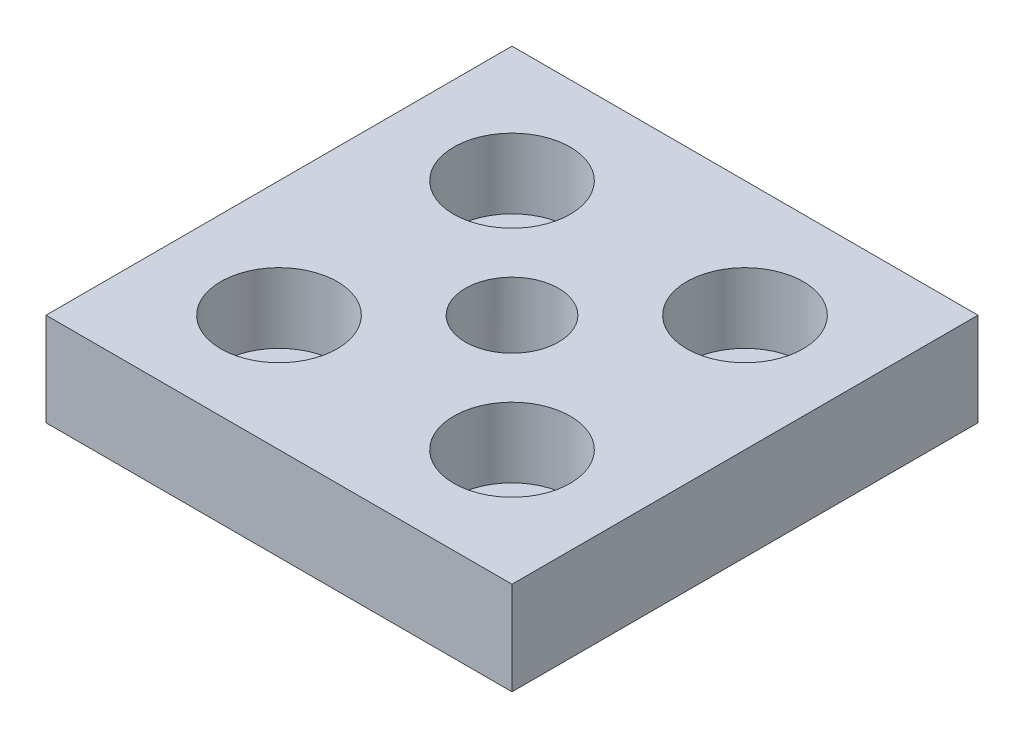
ISO-10303-21;
HEADER;
FILE_DESCRIPTION(('STEP AP214'),'2;1');
FILE_NAME('part.step','',(''),(''),'','','');
FILE_SCHEMA(('AUTOMOTIVE_DESIGN { 1 0 10303 214 1 1 1 1 }'));
ENDSEC;
DATA;
#1=APPLICATION_CONTEXT('core data for automotive mechanical design processes');
#2=APPLICATION_PROTOCOL_DEFINITION('international standard','automotive_design',2000,#1);
#3=PRODUCT_CONTEXT('',#1,'mechanical');
#4=PRODUCT('Part','Part','',(#3));
#5=PRODUCT_RELATED_PRODUCT_CATEGORY('part','',(#4));
#6=PRODUCT_DEFINITION_FORMATION('','',#4);
#7=PRODUCT_DEFINITION_CONTEXT('part definition',#1,'design');
#8=PRODUCT_DEFINITION('design','',#6,#7);
#9=PRODUCT_DEFINITION_SHAPE('','',#8);
#10=(LENGTH_UNIT() NAMED_UNIT(*) SI_UNIT(.MILLI.,.METRE.));
#11=(NAMED_UNIT(*) PLANE_ANGLE_UNIT() SI_UNIT($,.RADIAN.));
#12=(NAMED_UNIT(*) SI_UNIT($,.STERADIAN.) SOLID_ANGLE_UNIT());
#13=UNCERTAINTY_MEASURE_WITH_UNIT(LENGTH_MEASURE(1.E-05),#10,'distance_accuracy_value','');
#14=(GEOMETRIC_REPRESENTATION_CONTEXT(3) GLOBAL_UNCERTAINTY_ASSIGNED_CONTEXT((#13)) GLOBAL_UNIT_ASSIGNED_CONTEXT((#10,
#11,#12)) REPRESENTATION_CONTEXT('',''));
#15=CARTESIAN_POINT('',(0.,0.,0.));
#16=DIRECTION('',(0.,0.,1.));
#17=DIRECTION('',(1.,0.,0.));
#18=AXIS2_PLACEMENT_3D('',#15,#16,#17);
#19=CARTESIAN_POINT('',(-15.,0.,-15.));
#20=DIRECTION('',(0.,1.,0.));
#21=DIRECTION('',(0.,0.,1.));
#22=AXIS2_PLACEMENT_3D('',#19,#20,#21);
#23=CYLINDRICAL_SURFACE('',#22,4.5);
#24=CARTESIAN_POINT('',(-15.,0.,-15.));
#25=DIRECTION('',(0.,1.,0.));
#26=DIRECTION('',(0.,0.,1.));
#27=AXIS2_PLACEMENT_3D('',#24,#25,#26);
#28=CIRCLE('',#27,4.5);
#29=CARTESIAN_POINT('',(-15.,0.,-10.5));
#30=VERTEX_POINT('',#29);
#31=EDGE_CURVE('E137',#30,#30,#28,.T.);
#32=ORIENTED_EDGE('',*,*,#31,.F.);
#33=EDGE_LOOP('',(#32));
#34=FACE_BOUND('',#33,.T.);
#35=CARTESIAN_POINT('',(-15.,3.,-15.));
#36=DIRECTION('',(0.,1.,0.));
#37=DIRECTION('',(0.,0.,1.));
#38=AXIS2_PLACEMENT_3D('',#35,#36,#37);
#39=CIRCLE('',#38,4.5);
#40=CARTESIAN_POINT('',(-15.,3.,-10.5));
#41=VERTEX_POINT('',#40);
#42=EDGE_CURVE('E41',#41,#41,#39,.F.);
#43=ORIENTED_EDGE('',*,*,#42,.F.);
#44=EDGE_LOOP('',(#43));
#45=FACE_BOUND('',#44,.T.);
#46=ADVANCED_FACE('F37',(#34,#45),#23,.F.);
#47=CARTESIAN_POINT('',(15.,0.,-15.));
#48=DIRECTION('',(0.,1.,0.));
#49=DIRECTION('',(0.,0.,1.));
#50=AXIS2_PLACEMENT_3D('',#47,#48,#49);
#51=CYLINDRICAL_SURFACE('',#50,4.5);
#52=CARTESIAN_POINT('',(15.,0.,-15.));
#53=DIRECTION('',(0.,1.,0.));
#54=DIRECTION('',(0.,0.,1.));
#55=AXIS2_PLACEMENT_3D('',#52,#53,#54);
#56=CIRCLE('',#55,4.5);
#57=CARTESIAN_POINT('',(15.,0.,-10.5));
#58=VERTEX_POINT('',#57);
#59=EDGE_CURVE('E133',#58,#58,#56,.T.);
#60=ORIENTED_EDGE('',*,*,#59,.F.);
#61=EDGE_LOOP('',(#60));
#62=FACE_BOUND('',#61,.T.);
#63=CARTESIAN_POINT('',(15.,3.,-15.));
#64=DIRECTION('',(0.,1.,0.));
#65=DIRECTION('',(0.,0.,1.));
#66=AXIS2_PLACEMENT_3D('',#63,#64,#65);
#67=CIRCLE('',#66,4.5);
#68=CARTESIAN_POINT('',(15.,3.,-10.5));
#69=VERTEX_POINT('',#68);
#70=EDGE_CURVE('E119',#69,#69,#67,.F.);
#71=ORIENTED_EDGE('',*,*,#70,.F.);
#72=EDGE_LOOP('',(#71));
#73=FACE_BOUND('',#72,.T.);
#74=ADVANCED_FACE('F165',(#62,#73),#51,.F.);
#75=CARTESIAN_POINT('',(15.,0.,15.));
#76=DIRECTION('',(0.,1.,0.));
#77=DIRECTION('',(0.,0.,1.));
#78=AXIS2_PLACEMENT_3D('',#75,#76,#77);
#79=CYLINDRICAL_SURFACE('',#78,4.5);
#80=CARTESIAN_POINT('',(15.,0.,15.));
#81=DIRECTION('',(0.,1.,0.));
#82=DIRECTION('',(0.,0.,1.));
#83=AXIS2_PLACEMENT_3D('',#80,#81,#82);
#84=CIRCLE('',#83,4.5);
#85=CARTESIAN_POINT('',(15.,0.,19.5));
#86=VERTEX_POINT('',#85);
#87=EDGE_CURVE('E128',#86,#86,#84,.T.);
#88=ORIENTED_EDGE('',*,*,#87,.F.);
#89=EDGE_LOOP('',(#88));
#90=FACE_BOUND('',#89,.T.);
#91=CARTESIAN_POINT('',(15.,3.,15.));
#92=DIRECTION('',(0.,1.,0.));
#93=DIRECTION('',(0.,0.,1.));
#94=AXIS2_PLACEMENT_3D('',#91,#92,#93);
#95=CIRCLE('',#94,4.5);
#96=CARTESIAN_POINT('',(15.,3.,19.5));
#97=VERTEX_POINT('',#96);
#98=EDGE_CURVE('E116',#97,#97,#95,.F.);
#99=ORIENTED_EDGE('',*,*,#98,.F.);
#100=EDGE_LOOP('',(#99));
#101=FACE_BOUND('',#100,.T.);
#102=ADVANCED_FACE('F171',(#90,#101),#79,.F.);
#103=CARTESIAN_POINT('',(-15.,0.,15.));
#104=DIRECTION('',(0.,1.,0.));
#105=DIRECTION('',(0.,0.,1.));
#106=AXIS2_PLACEMENT_3D('',#103,#104,#105);
#107=CYLINDRICAL_SURFACE('',#106,4.5);
#108=CARTESIAN_POINT('',(-15.,0.,15.));
#109=DIRECTION('',(0.,1.,0.));
#110=DIRECTION('',(0.,0.,1.));
#111=AXIS2_PLACEMENT_3D('',#108,#109,#110);
#112=CIRCLE('',#111,4.5);
#113=CARTESIAN_POINT('',(-15.,0.,19.5));
#114=VERTEX_POINT('',#113);
#115=EDGE_CURVE('E124',#114,#114,#112,.T.);
#116=ORIENTED_EDGE('',*,*,#115,.F.);
#117=EDGE_LOOP('',(#116));
#118=FACE_BOUND('',#117,.T.);
#119=CARTESIAN_POINT('',(-15.,3.,15.));
#120=DIRECTION('',(0.,1.,0.));
#121=DIRECTION('',(0.,0.,1.));
#122=AXIS2_PLACEMENT_3D('',#119,#120,#121);
#123=CIRCLE('',#122,4.5);
#124=CARTESIAN_POINT('',(-15.,3.,19.5));
#125=VERTEX_POINT('',#124);
#126=EDGE_CURVE('E113',#125,#125,#123,.F.);
#127=ORIENTED_EDGE('',*,*,#126,.F.);
#128=EDGE_LOOP('',(#127));
#129=FACE_BOUND('',#128,.T.);
#130=ADVANCED_FACE('F178',(#118,#129),#107,.F.);
#131=CARTESIAN_POINT('',(30.,12.,30.));
#132=DIRECTION('',(-1.,0.,0.));
#133=DIRECTION('',(0.,0.,1.));
#134=AXIS2_PLACEMENT_3D('',#131,#132,#133);
#135=PLANE('',#134);
#136=DIRECTION('',(0.,0.,-1.));
#137=VECTOR('',#136,1.);
#138=CARTESIAN_POINT('',(30.,0.,30.));
#139=LINE('',#138,#137);
#140=CARTESIAN_POINT('',(30.,0.,30.));
#141=VERTEX_POINT('',#140);
#142=CARTESIAN_POINT('',(30.,0.,-30.));
#143=VERTEX_POINT('',#142);
#144=EDGE_CURVE('E104',#141,#143,#139,.T.);
#145=ORIENTED_EDGE('',*,*,#144,.T.);
#146=DIRECTION('',(0.,-1.,0.));
#147=VECTOR('',#146,1.);
#148=CARTESIAN_POINT('',(30.,12.,-30.));
#149=LINE('',#148,#147);
#150=CARTESIAN_POINT('',(30.,12.,-30.));
#151=VERTEX_POINT('',#150);
#152=EDGE_CURVE('E11',#151,#143,#149,.T.);
#153=ORIENTED_EDGE('',*,*,#152,.F.);
#154=DIRECTION('',(0.,0.,-1.));
#155=VECTOR('',#154,1.);
#156=CARTESIAN_POINT('',(30.,12.,30.));
#157=LINE('',#156,#155);
#158=CARTESIAN_POINT('',(30.,12.,30.));
#159=VERTEX_POINT('',#158);
#160=EDGE_CURVE('E91',#159,#151,#157,.T.);
#161=ORIENTED_EDGE('',*,*,#160,.F.);
#162=DIRECTION('',(0.,-1.,0.));
#163=VECTOR('',#162,1.);
#164=CARTESIAN_POINT('',(30.,12.,30.));
#165=LINE('',#164,#163);
#166=EDGE_CURVE('E100',#159,#141,#165,.T.);
#167=ORIENTED_EDGE('',*,*,#166,.T.);
#168=EDGE_LOOP('',(#145,#153,#161,#167));
#169=FACE_BOUND('',#168,.T.);
#170=ADVANCED_FACE('F39',(#169),#135,.F.);
#171=CARTESIAN_POINT('',(-30.,12.,-30.));
#172=DIRECTION('',(0.,0.,1.));
#173=DIRECTION('',(1.,0.,0.));
#174=AXIS2_PLACEMENT_3D('',#171,#172,#173);
#175=PLANE('',#174);
#176=DIRECTION('',(-1.,0.,0.));
#177=VECTOR('',#176,1.);
#178=CARTESIAN_POINT('',(-30.,0.,-30.));
#179=LINE('',#178,#177);
#180=CARTESIAN_POINT('',(-30.,0.,-30.));
#181=VERTEX_POINT('',#180);
#182=EDGE_CURVE('E95',#143,#181,#179,.T.);
#183=ORIENTED_EDGE('',*,*,#182,.T.);
#184=DIRECTION('',(0.,-1.,0.));
#185=VECTOR('',#184,1.);
#186=CARTESIAN_POINT('',(-30.,12.,-30.));
#187=LINE('',#186,#185);
#188=CARTESIAN_POINT('',(-30.,12.,-30.));
#189=VERTEX_POINT('',#188);
#190=EDGE_CURVE('E47',#189,#181,#187,.T.);
#191=ORIENTED_EDGE('',*,*,#190,.F.);
#192=DIRECTION('',(-1.,0.,0.));
#193=VECTOR('',#192,1.);
#194=CARTESIAN_POINT('',(-30.,12.,-30.));
#195=LINE('',#194,#193);
#196=EDGE_CURVE('E86',#151,#189,#195,.T.);
#197=ORIENTED_EDGE('',*,*,#196,.F.);
#198=ORIENTED_EDGE('',*,*,#152,.T.);
#199=EDGE_LOOP('',(#183,#191,#197,#198));
#200=FACE_BOUND('',#199,.T.);
#201=ADVANCED_FACE('F94',(#200),#175,.F.);
#202=CARTESIAN_POINT('',(-30.,12.,30.));
#203=DIRECTION('',(1.,0.,0.));
#204=DIRECTION('',(0.,0.,-1.));
#205=AXIS2_PLACEMENT_3D('',#202,#203,#204);
#206=PLANE('',#205);
#207=DIRECTION('',(0.,0.,1.));
#208=VECTOR('',#207,1.);
#209=CARTESIAN_POINT('',(-30.,0.,30.));
#210=LINE('',#209,#208);
#211=CARTESIAN_POINT('',(-30.,0.,30.));
#212=VERTEX_POINT('',#211);
#213=EDGE_CURVE('E73',#181,#212,#210,.T.);
#214=ORIENTED_EDGE('',*,*,#213,.T.);
#215=DIRECTION('',(0.,-1.,0.));
#216=VECTOR('',#215,1.);
#217=CARTESIAN_POINT('',(-30.,12.,30.));
#218=LINE('',#217,#216);
#219=CARTESIAN_POINT('',(-30.,12.,30.));
#220=VERTEX_POINT('',#219);
#221=EDGE_CURVE('E96',#220,#212,#218,.T.);
#222=ORIENTED_EDGE('',*,*,#221,.F.);
#223=DIRECTION('',(0.,0.,1.));
#224=VECTOR('',#223,1.);
#225=CARTESIAN_POINT('',(-30.,12.,30.));
#226=LINE('',#225,#224);
#227=EDGE_CURVE('E89',#189,#220,#226,.T.);
#228=ORIENTED_EDGE('',*,*,#227,.F.);
#229=ORIENTED_EDGE('',*,*,#190,.T.);
#230=EDGE_LOOP('',(#214,#222,#228,#229));
#231=FACE_BOUND('',#230,.T.);
#232=ADVANCED_FACE('F98',(#231),#206,.F.);
#233=CARTESIAN_POINT('',(-30.,12.,30.));
#234=DIRECTION('',(0.,0.,-1.));
#235=DIRECTION('',(-1.,0.,0.));
#236=AXIS2_PLACEMENT_3D('',#233,#234,#235);
#237=PLANE('',#236);
#238=DIRECTION('',(1.,0.,0.));
#239=VECTOR('',#238,1.);
#240=CARTESIAN_POINT('',(-30.,0.,30.));
#241=LINE('',#240,#239);
#242=EDGE_CURVE('E79',#212,#141,#241,.T.);
#243=ORIENTED_EDGE('',*,*,#242,.T.);
#244=ORIENTED_EDGE('',*,*,#166,.F.);
#245=DIRECTION('',(1.,0.,0.));
#246=VECTOR('',#245,1.);
#247=CARTESIAN_POINT('',(-30.,12.,30.));
#248=LINE('',#247,#246);
#249=EDGE_CURVE('E56',#220,#159,#248,.T.);
#250=ORIENTED_EDGE('',*,*,#249,.F.);
#251=ORIENTED_EDGE('',*,*,#221,.T.);
#252=EDGE_LOOP('',(#243,#244,#250,#251));
#253=FACE_BOUND('',#252,.T.);
#254=ADVANCED_FACE('F154',(#253),#237,.F.);
#255=CARTESIAN_POINT('',(0.,12.,0.));
#256=DIRECTION('',(0.,-1.,0.));
#257=DIRECTION('',(0.,0.,-1.));
#258=AXIS2_PLACEMENT_3D('',#255,#256,#257);
#259=PLANE('',#258);
#260=CARTESIAN_POINT('',(-15.,12.,15.));
#261=DIRECTION('',(0.,1.,0.));
#262=DIRECTION('',(0.,0.,1.));
#263=AXIS2_PLACEMENT_3D('',#260,#261,#262);
#264=CIRCLE('',#263,7.5);
#265=CARTESIAN_POINT('',(-15.,12.,22.5));
#266=VERTEX_POINT('',#265);
#267=EDGE_CURVE('E255',#266,#266,#264,.T.);
#268=ORIENTED_EDGE('',*,*,#267,.F.);
#269=EDGE_LOOP('',(#268));
#270=FACE_BOUND('',#269,.T.);
#271=CARTESIAN_POINT('',(15.,12.,15.));
#272=DIRECTION('',(0.,1.,0.));
#273=DIRECTION('',(0.,0.,1.));
#274=AXIS2_PLACEMENT_3D('',#271,#272,#273);
#275=CIRCLE('',#274,7.5);
#276=CARTESIAN_POINT('',(15.,12.,22.5));
#277=VERTEX_POINT('',#276);
#278=EDGE_CURVE('E250',#277,#277,#275,.T.);
#279=ORIENTED_EDGE('',*,*,#278,.F.);
#280=EDGE_LOOP('',(#279));
#281=FACE_BOUND('',#280,.T.);
#282=CARTESIAN_POINT('',(15.,12.,-15.));
#283=DIRECTION('',(0.,1.,0.));
#284=DIRECTION('',(0.,0.,1.));
#285=AXIS2_PLACEMENT_3D('',#282,#283,#284);
#286=CIRCLE('',#285,7.5);
#287=CARTESIAN_POINT('',(15.,12.,-7.5));
#288=VERTEX_POINT('',#287);
#289=EDGE_CURVE('E241',#288,#288,#286,.T.);
#290=ORIENTED_EDGE('',*,*,#289,.F.);
#291=EDGE_LOOP('',(#290));
#292=FACE_BOUND('',#291,.T.);
#293=CARTESIAN_POINT('',(-15.,12.,-15.));
#294=DIRECTION('',(0.,1.,0.));
#295=DIRECTION('',(0.,0.,1.));
#296=AXIS2_PLACEMENT_3D('',#293,#294,#295);
#297=CIRCLE('',#296,7.5);
#298=CARTESIAN_POINT('',(-15.,12.,-7.5));
#299=VERTEX_POINT('',#298);
#300=EDGE_CURVE('E240',#299,#299,#297,.T.);
#301=ORIENTED_EDGE('',*,*,#300,.F.);
#302=EDGE_LOOP('',(#301));
#303=FACE_BOUND('',#302,.T.);
#304=CARTESIAN_POINT('',(0.,12.,0.));
#305=DIRECTION('',(0.,1.,0.));
#306=DIRECTION('',(0.,0.,1.));
#307=AXIS2_PLACEMENT_3D('',#304,#305,#306);
#308=CIRCLE('',#307,6.);
#309=CARTESIAN_POINT('',(0.,12.,6.));
#310=VERTEX_POINT('',#309);
#311=EDGE_CURVE('E140',#310,#310,#308,.T.);
#312=ORIENTED_EDGE('',*,*,#311,.F.);
#313=EDGE_LOOP('',(#312));
#314=FACE_BOUND('',#313,.T.);
#315=ORIENTED_EDGE('',*,*,#160,.T.);
#316=ORIENTED_EDGE('',*,*,#196,.T.);
#317=ORIENTED_EDGE('',*,*,#227,.T.);
#318=ORIENTED_EDGE('',*,*,#249,.T.);
#319=EDGE_LOOP('',(#315,#316,#317,#318));
#320=FACE_BOUND('',#319,.T.);
#321=ADVANCED_FACE('F87',(#270,#281,#292,#303,#314,#320),#259,.F.);
#322=CARTESIAN_POINT('',(0.,0.,0.));
#323=DIRECTION('',(0.,-1.,0.));
#324=DIRECTION('',(0.,0.,-1.));
#325=AXIS2_PLACEMENT_3D('',#322,#323,#324);
#326=PLANE('',#325);
#327=ORIENTED_EDGE('',*,*,#115,.T.);
#328=EDGE_LOOP('',(#327));
#329=FACE_BOUND('',#328,.T.);
#330=ORIENTED_EDGE('',*,*,#87,.T.);
#331=EDGE_LOOP('',(#330));
#332=FACE_BOUND('',#331,.T.);
#333=ORIENTED_EDGE('',*,*,#59,.T.);
#334=EDGE_LOOP('',(#333));
#335=FACE_BOUND('',#334,.T.);
#336=ORIENTED_EDGE('',*,*,#31,.T.);
#337=EDGE_LOOP('',(#336));
#338=FACE_BOUND('',#337,.T.);
#339=CARTESIAN_POINT('',(0.,0.,0.));
#340=DIRECTION('',(0.,-1.,0.));
#341=DIRECTION('',(0.,0.,-1.));
#342=AXIS2_PLACEMENT_3D('',#339,#340,#341);
#343=CIRCLE('',#342,6.);
#344=CARTESIAN_POINT('',(0.,0.,-6.));
#345=VERTEX_POINT('',#344);
#346=EDGE_CURVE('E107',#345,#345,#343,.T.);
#347=ORIENTED_EDGE('',*,*,#346,.F.);
#348=EDGE_LOOP('',(#347));
#349=FACE_BOUND('',#348,.T.);
#350=ORIENTED_EDGE('',*,*,#144,.F.);
#351=ORIENTED_EDGE('',*,*,#242,.F.);
#352=ORIENTED_EDGE('',*,*,#213,.F.);
#353=ORIENTED_EDGE('',*,*,#182,.F.);
#354=EDGE_LOOP('',(#350,#351,#352,#353));
#355=FACE_BOUND('',#354,.T.);
#356=ADVANCED_FACE('F148',(#329,#332,#335,#338,#349,#355),#326,.T.);
#357=CARTESIAN_POINT('',(0.,12.,0.));
#358=DIRECTION('',(0.,1.,0.));
#359=DIRECTION('',(0.,0.,1.));
#360=AXIS2_PLACEMENT_3D('',#357,#358,#359);
#361=CYLINDRICAL_SURFACE('',#360,6.);
#362=ORIENTED_EDGE('',*,*,#311,.T.);
#363=EDGE_LOOP('',(#362));
#364=FACE_BOUND('',#363,.T.);
#365=ORIENTED_EDGE('',*,*,#346,.T.);
#366=EDGE_LOOP('',(#365));
#367=FACE_BOUND('',#366,.T.);
#368=ADVANCED_FACE('F146',(#364,#367),#361,.F.);
#369=CARTESIAN_POINT('',(-15.,3.,15.));
#370=DIRECTION('',(0.,1.,0.));
#371=DIRECTION('',(0.,0.,1.));
#372=AXIS2_PLACEMENT_3D('',#369,#370,#371);
#373=PLANE('',#372);
#374=CARTESIAN_POINT('',(-15.,3.,15.));
#375=DIRECTION('',(0.,1.,0.));
#376=DIRECTION('',(0.,0.,1.));
#377=AXIS2_PLACEMENT_3D('',#374,#375,#376);
#378=CIRCLE('',#377,7.5);
#379=CARTESIAN_POINT('',(-15.,3.,22.5));
#380=VERTEX_POINT('',#379);
#381=EDGE_CURVE('E253',#380,#380,#378,.T.);
#382=ORIENTED_EDGE('',*,*,#381,.T.);
#383=EDGE_LOOP('',(#382));
#384=FACE_BOUND('',#383,.T.);
#385=ORIENTED_EDGE('',*,*,#126,.T.);
#386=EDGE_LOOP('',(#385));
#387=FACE_BOUND('',#386,.T.);
#388=ADVANCED_FACE('F181',(#384,#387),#373,.T.);
#389=CARTESIAN_POINT('',(-15.,3.,15.));
#390=DIRECTION('',(0.,1.,0.));
#391=DIRECTION('',(0.,0.,1.));
#392=AXIS2_PLACEMENT_3D('',#389,#390,#391);
#393=CYLINDRICAL_SURFACE('',#392,7.5);
#394=ORIENTED_EDGE('',*,*,#381,.F.);
#395=EDGE_LOOP('',(#394));
#396=FACE_BOUND('',#395,.T.);
#397=ORIENTED_EDGE('',*,*,#267,.T.);
#398=EDGE_LOOP('',(#397));
#399=FACE_BOUND('',#398,.T.);
#400=ADVANCED_FACE('F186',(#396,#399),#393,.F.);
#401=CARTESIAN_POINT('',(15.,3.,15.));
#402=DIRECTION('',(0.,1.,0.));
#403=DIRECTION('',(0.,0.,1.));
#404=AXIS2_PLACEMENT_3D('',#401,#402,#403);
#405=PLANE('',#404);
#406=CARTESIAN_POINT('',(15.,3.,15.));
#407=DIRECTION('',(0.,1.,0.));
#408=DIRECTION('',(0.,0.,1.));
#409=AXIS2_PLACEMENT_3D('',#406,#407,#408);
#410=CIRCLE('',#409,7.5);
#411=CARTESIAN_POINT('',(15.,3.,22.5));
#412=VERTEX_POINT('',#411);
#413=EDGE_CURVE('E246',#412,#412,#410,.T.);
#414=ORIENTED_EDGE('',*,*,#413,.T.);
#415=EDGE_LOOP('',(#414));
#416=FACE_BOUND('',#415,.T.);
#417=ORIENTED_EDGE('',*,*,#98,.T.);
#418=EDGE_LOOP('',(#417));
#419=FACE_BOUND('',#418,.T.);
#420=ADVANCED_FACE('F194',(#416,#419),#405,.T.);
#421=CARTESIAN_POINT('',(15.,3.,15.));
#422=DIRECTION('',(0.,1.,0.));
#423=DIRECTION('',(0.,0.,1.));
#424=AXIS2_PLACEMENT_3D('',#421,#422,#423);
#425=CYLINDRICAL_SURFACE('',#424,7.5);
#426=ORIENTED_EDGE('',*,*,#413,.F.);
#427=EDGE_LOOP('',(#426));
#428=FACE_BOUND('',#427,.T.);
#429=ORIENTED_EDGE('',*,*,#278,.T.);
#430=EDGE_LOOP('',(#429));
#431=FACE_BOUND('',#430,.T.);
#432=ADVANCED_FACE('F200',(#428,#431),#425,.F.);
#433=CARTESIAN_POINT('',(15.,3.,-15.));
#434=DIRECTION('',(0.,1.,0.));
#435=DIRECTION('',(0.,0.,1.));
#436=AXIS2_PLACEMENT_3D('',#433,#434,#435);
#437=PLANE('',#436);
#438=CARTESIAN_POINT('',(15.,3.,-15.));
#439=DIRECTION('',(0.,1.,0.));
#440=DIRECTION('',(0.,0.,1.));
#441=AXIS2_PLACEMENT_3D('',#438,#439,#440);
#442=CIRCLE('',#441,7.5);
#443=CARTESIAN_POINT('',(15.,3.,-7.5));
#444=VERTEX_POINT('',#443);
#445=EDGE_CURVE('E239',#444,#444,#442,.T.);
#446=ORIENTED_EDGE('',*,*,#445,.T.);
#447=EDGE_LOOP('',(#446));
#448=FACE_BOUND('',#447,.T.);
#449=ORIENTED_EDGE('',*,*,#70,.T.);
#450=EDGE_LOOP('',(#449));
#451=FACE_BOUND('',#450,.T.);
#452=ADVANCED_FACE('F226',(#448,#451),#437,.T.);
#453=CARTESIAN_POINT('',(15.,3.,-15.));
#454=DIRECTION('',(0.,1.,0.));
#455=DIRECTION('',(0.,0.,1.));
#456=AXIS2_PLACEMENT_3D('',#453,#454,#455);
#457=CYLINDRICAL_SURFACE('',#456,7.5);
#458=ORIENTED_EDGE('',*,*,#445,.F.);
#459=EDGE_LOOP('',(#458));
#460=FACE_BOUND('',#459,.T.);
#461=ORIENTED_EDGE('',*,*,#289,.T.);
#462=EDGE_LOOP('',(#461));
#463=FACE_BOUND('',#462,.T.);
#464=ADVANCED_FACE('F207',(#460,#463),#457,.F.);
#465=CARTESIAN_POINT('',(-15.,3.,-15.));
#466=DIRECTION('',(0.,1.,0.));
#467=DIRECTION('',(0.,0.,1.));
#468=AXIS2_PLACEMENT_3D('',#465,#466,#467);
#469=PLANE('',#468);
#470=CARTESIAN_POINT('',(-15.,3.,-15.));
#471=DIRECTION('',(0.,1.,0.));
#472=DIRECTION('',(0.,0.,1.));
#473=AXIS2_PLACEMENT_3D('',#470,#471,#472);
#474=CIRCLE('',#473,7.5);
#475=CARTESIAN_POINT('',(-15.,3.,-7.5));
#476=VERTEX_POINT('',#475);
#477=EDGE_CURVE('E117',#476,#476,#474,.T.);
#478=ORIENTED_EDGE('',*,*,#477,.T.);
#479=EDGE_LOOP('',(#478));
#480=FACE_BOUND('',#479,.T.);
#481=ORIENTED_EDGE('',*,*,#42,.T.);
#482=EDGE_LOOP('',(#481));
#483=FACE_BOUND('',#482,.T.);
#484=ADVANCED_FACE('F203',(#480,#483),#469,.T.);
#485=CARTESIAN_POINT('',(-15.,3.,-15.));
#486=DIRECTION('',(0.,1.,0.));
#487=DIRECTION('',(0.,0.,1.));
#488=AXIS2_PLACEMENT_3D('',#485,#486,#487);
#489=CYLINDRICAL_SURFACE('',#488,7.5);
#490=ORIENTED_EDGE('',*,*,#477,.F.);
#491=EDGE_LOOP('',(#490));
#492=FACE_BOUND('',#491,.T.);
#493=ORIENTED_EDGE('',*,*,#300,.T.);
#494=EDGE_LOOP('',(#493));
#495=FACE_BOUND('',#494,.T.);
#496=ADVANCED_FACE('F206',(#492,#495),#489,.F.);
#497=CLOSED_SHELL('',(#46,#74,#102,#130,#170,#201,#232,#254,#321,#356,#368,#388,#400,#420,#432,
#452,#464,#484,#496));
#498=MANIFOLD_SOLID_BREP('B2',#497);
#499=ADVANCED_BREP_SHAPE_REPRESENTATION('',(#18,#498),#14);
#500=SHAPE_DEFINITION_REPRESENTATION(#9,#499);
ENDSEC;
END-ISO-10303-21;
